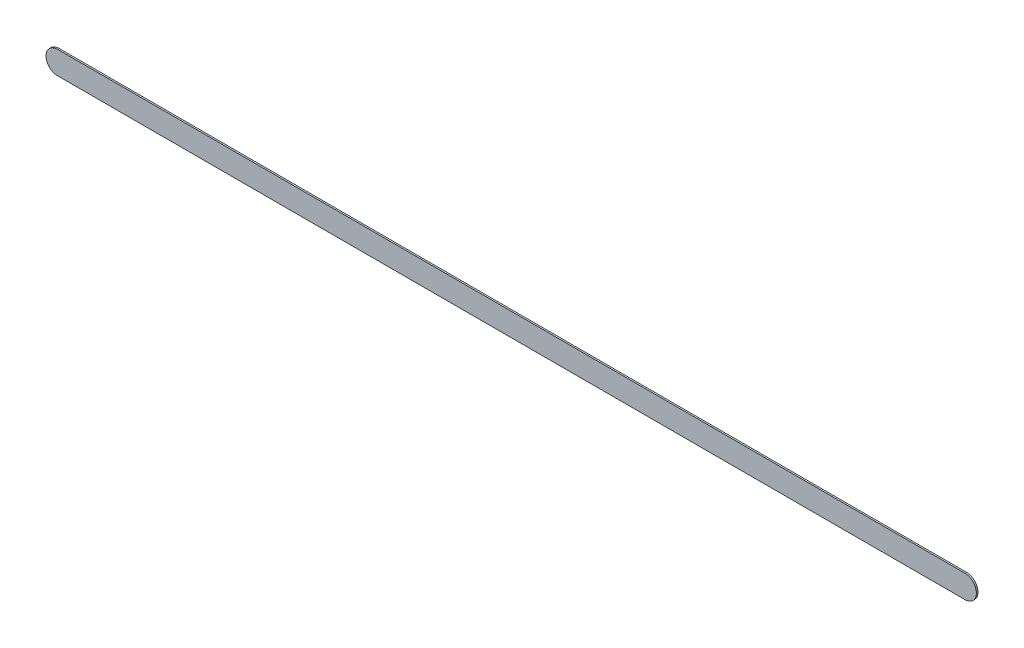
ISO-10303-21;
HEADER;
FILE_DESCRIPTION(('STEP AP214'),'2;1');
FILE_NAME('part.step','',(''),(''),'','','');
FILE_SCHEMA(('AUTOMOTIVE_DESIGN { 1 0 10303 214 1 1 1 1 }'));
ENDSEC;
DATA;
#1=APPLICATION_CONTEXT('core data for automotive mechanical design processes');
#2=APPLICATION_PROTOCOL_DEFINITION('international standard','automotive_design',2000,#1);
#3=PRODUCT_CONTEXT('',#1,'mechanical');
#4=PRODUCT('Part','Part','',(#3));
#5=PRODUCT_RELATED_PRODUCT_CATEGORY('part','',(#4));
#6=PRODUCT_DEFINITION_FORMATION('','',#4);
#7=PRODUCT_DEFINITION_CONTEXT('part definition',#1,'design');
#8=PRODUCT_DEFINITION('design','',#6,#7);
#9=PRODUCT_DEFINITION_SHAPE('','',#8);
#10=(LENGTH_UNIT() NAMED_UNIT(*) SI_UNIT(.MILLI.,.METRE.));
#11=(NAMED_UNIT(*) PLANE_ANGLE_UNIT() SI_UNIT($,.RADIAN.));
#12=(NAMED_UNIT(*) SI_UNIT($,.STERADIAN.) SOLID_ANGLE_UNIT());
#13=UNCERTAINTY_MEASURE_WITH_UNIT(LENGTH_MEASURE(1.E-05),#10,'distance_accuracy_value','');
#14=(GEOMETRIC_REPRESENTATION_CONTEXT(3) GLOBAL_UNCERTAINTY_ASSIGNED_CONTEXT((#13)) GLOBAL_UNIT_ASSIGNED_CONTEXT((#10,
#11,#12)) REPRESENTATION_CONTEXT('',''));
#15=CARTESIAN_POINT('',(0.,0.,0.));
#16=DIRECTION('',(0.,0.,1.));
#17=DIRECTION('',(1.,0.,0.));
#18=AXIS2_PLACEMENT_3D('',#15,#16,#17);
#19=CARTESIAN_POINT('',(146.945981,-70.362,0.));
#20=DIRECTION('',(0.,0.,1.));
#21=DIRECTION('',(1.,0.,0.));
#22=AXIS2_PLACEMENT_3D('',#19,#20,#21);
#23=PLANE('',#22);
#24=DIRECTION('',(-1.,0.,0.));
#25=VECTOR('',#24,1.);
#26=CARTESIAN_POINT('',(146.945981,-70.362,0.));
#27=LINE('',#26,#25);
#28=CARTESIAN_POINT('',(146.945981,-70.362,0.));
#29=VERTEX_POINT('',#28);
#30=CARTESIAN_POINT('',(127.127,-70.362,0.));
#31=VERTEX_POINT('',#30);
#32=EDGE_CURVE('E82',#29,#31,#27,.T.);
#33=ORIENTED_EDGE('',*,*,#32,.T.);
#34=CARTESIAN_POINT('',(127.127,-70.612,0.));
#35=DIRECTION('',(0.,0.,1.));
#36=DIRECTION('',(0.,1.,0.));
#37=AXIS2_PLACEMENT_3D('',#34,#35,#36);
#38=CIRCLE('',#37,0.25);
#39=CARTESIAN_POINT('',(127.127,-70.862,0.));
#40=VERTEX_POINT('',#39);
#41=EDGE_CURVE('E108',#31,#40,#38,.T.);
#42=ORIENTED_EDGE('',*,*,#41,.T.);
#43=DIRECTION('',(1.,0.,0.));
#44=VECTOR('',#43,1.);
#45=CARTESIAN_POINT('',(127.127,-70.862,0.));
#46=LINE('',#45,#44);
#47=CARTESIAN_POINT('',(146.945981,-70.862,0.));
#48=VERTEX_POINT('',#47);
#49=EDGE_CURVE('E75',#40,#48,#46,.T.);
#50=ORIENTED_EDGE('',*,*,#49,.T.);
#51=CARTESIAN_POINT('',(146.945981,-70.612,0.));
#52=DIRECTION('',(0.,0.,1.));
#53=DIRECTION('',(0.,-1.,0.));
#54=AXIS2_PLACEMENT_3D('',#51,#52,#53);
#55=CIRCLE('',#54,0.25);
#56=EDGE_CURVE('E11',#48,#29,#55,.T.);
#57=ORIENTED_EDGE('',*,*,#56,.T.);
#58=EDGE_LOOP('',(#33,#42,#50,#57));
#59=FACE_BOUND('',#58,.T.);
#60=ADVANCED_FACE('F17',(#59),#23,.T.);
#61=CARTESIAN_POINT('',(146.945981,-70.362,-0.035));
#62=DIRECTION('',(0.,0.,1.));
#63=DIRECTION('',(1.,0.,0.));
#64=AXIS2_PLACEMENT_3D('',#61,#62,#63);
#65=PLANE('',#64);
#66=CARTESIAN_POINT('',(146.945981,-70.612,-0.035));
#67=DIRECTION('',(0.,0.,1.));
#68=DIRECTION('',(0.,-1.,0.));
#69=AXIS2_PLACEMENT_3D('',#66,#67,#68);
#70=CIRCLE('',#69,0.25);
#71=CARTESIAN_POINT('',(146.945981,-70.862,-0.035));
#72=VERTEX_POINT('',#71);
#73=CARTESIAN_POINT('',(146.945981,-70.362,-0.035));
#74=VERTEX_POINT('',#73);
#75=EDGE_CURVE('E20',#72,#74,#70,.T.);
#76=ORIENTED_EDGE('',*,*,#75,.F.);
#77=DIRECTION('',(1.,0.,0.));
#78=VECTOR('',#77,1.);
#79=CARTESIAN_POINT('',(127.127,-70.862,-0.035));
#80=LINE('',#79,#78);
#81=CARTESIAN_POINT('',(127.127,-70.862,-0.035));
#82=VERTEX_POINT('',#81);
#83=EDGE_CURVE('E105',#82,#72,#80,.T.);
#84=ORIENTED_EDGE('',*,*,#83,.F.);
#85=CARTESIAN_POINT('',(127.127,-70.612,-0.035));
#86=DIRECTION('',(0.,0.,1.));
#87=DIRECTION('',(0.,1.,0.));
#88=AXIS2_PLACEMENT_3D('',#85,#86,#87);
#89=CIRCLE('',#88,0.25);
#90=CARTESIAN_POINT('',(127.127,-70.362,-0.035));
#91=VERTEX_POINT('',#90);
#92=EDGE_CURVE('E84',#91,#82,#89,.T.);
#93=ORIENTED_EDGE('',*,*,#92,.F.);
#94=DIRECTION('',(-1.,0.,0.));
#95=VECTOR('',#94,1.);
#96=CARTESIAN_POINT('',(146.945981,-70.362,-0.035));
#97=LINE('',#96,#95);
#98=EDGE_CURVE('E80',#74,#91,#97,.T.);
#99=ORIENTED_EDGE('',*,*,#98,.F.);
#100=EDGE_LOOP('',(#76,#84,#93,#99));
#101=FACE_BOUND('',#100,.T.);
#102=ADVANCED_FACE('F86',(#101),#65,.F.);
#103=CARTESIAN_POINT('',(146.945981,-70.612,-0.035));
#104=DIRECTION('',(0.,0.,-1.));
#105=DIRECTION('',(0.,-1.,0.));
#106=AXIS2_PLACEMENT_3D('',#103,#104,#105);
#107=CYLINDRICAL_SURFACE('',#106,0.25);
#108=ORIENTED_EDGE('',*,*,#75,.T.);
#109=DIRECTION('',(0.,0.,1.));
#110=VECTOR('',#109,1.);
#111=CARTESIAN_POINT('',(146.945981,-70.362,-0.035));
#112=LINE('',#111,#110);
#113=EDGE_CURVE('E69',#74,#29,#112,.T.);
#114=ORIENTED_EDGE('',*,*,#113,.T.);
#115=ORIENTED_EDGE('',*,*,#56,.F.);
#116=DIRECTION('',(0.,0.,1.));
#117=VECTOR('',#116,1.);
#118=CARTESIAN_POINT('',(146.945981,-70.862,-0.035));
#119=LINE('',#118,#117);
#120=EDGE_CURVE('E72',#72,#48,#119,.T.);
#121=ORIENTED_EDGE('',*,*,#120,.F.);
#122=EDGE_LOOP('',(#108,#114,#115,#121));
#123=FACE_BOUND('',#122,.T.);
#124=ADVANCED_FACE('F68',(#123),#107,.T.);
#125=CARTESIAN_POINT('',(127.127,-70.862,-0.035));
#126=DIRECTION('',(0.,1.,0.));
#127=DIRECTION('',(1.,0.,0.));
#128=AXIS2_PLACEMENT_3D('',#125,#126,#127);
#129=PLANE('',#128);
#130=ORIENTED_EDGE('',*,*,#83,.T.);
#131=ORIENTED_EDGE('',*,*,#120,.T.);
#132=ORIENTED_EDGE('',*,*,#49,.F.);
#133=DIRECTION('',(0.,0.,1.));
#134=VECTOR('',#133,1.);
#135=CARTESIAN_POINT('',(127.127,-70.862,-0.035));
#136=LINE('',#135,#134);
#137=EDGE_CURVE('E101',#82,#40,#136,.T.);
#138=ORIENTED_EDGE('',*,*,#137,.F.);
#139=EDGE_LOOP('',(#130,#131,#132,#138));
#140=FACE_BOUND('',#139,.T.);
#141=ADVANCED_FACE('F120',(#140),#129,.F.);
#142=CARTESIAN_POINT('',(127.127,-70.612,-0.035));
#143=DIRECTION('',(0.,0.,-1.));
#144=DIRECTION('',(0.,1.,0.));
#145=AXIS2_PLACEMENT_3D('',#142,#143,#144);
#146=CYLINDRICAL_SURFACE('',#145,0.25);
#147=ORIENTED_EDGE('',*,*,#92,.T.);
#148=ORIENTED_EDGE('',*,*,#137,.T.);
#149=ORIENTED_EDGE('',*,*,#41,.F.);
#150=DIRECTION('',(0.,0.,1.));
#151=VECTOR('',#150,1.);
#152=CARTESIAN_POINT('',(127.127,-70.362,-0.035));
#153=LINE('',#152,#151);
#154=EDGE_CURVE('E90',#91,#31,#153,.T.);
#155=ORIENTED_EDGE('',*,*,#154,.F.);
#156=EDGE_LOOP('',(#147,#148,#149,#155));
#157=FACE_BOUND('',#156,.T.);
#158=ADVANCED_FACE('F122',(#157),#146,.T.);
#159=CARTESIAN_POINT('',(146.945981,-70.362,-0.035));
#160=DIRECTION('',(0.,-1.,0.));
#161=DIRECTION('',(0.,0.,-1.));
#162=AXIS2_PLACEMENT_3D('',#159,#160,#161);
#163=PLANE('',#162);
#164=ORIENTED_EDGE('',*,*,#98,.T.);
#165=ORIENTED_EDGE('',*,*,#154,.T.);
#166=ORIENTED_EDGE('',*,*,#32,.F.);
#167=ORIENTED_EDGE('',*,*,#113,.F.);
#168=EDGE_LOOP('',(#164,#165,#166,#167));
#169=FACE_BOUND('',#168,.T.);
#170=ADVANCED_FACE('F78',(#169),#163,.F.);
#171=CLOSED_SHELL('',(#60,#102,#124,#141,#158,#170));
#172=MANIFOLD_SOLID_BREP('B1',#171);
#173=ADVANCED_BREP_SHAPE_REPRESENTATION('',(#18,#172),#14);
#174=SHAPE_DEFINITION_REPRESENTATION(#9,#173);
ENDSEC;
END-ISO-10303-21;
